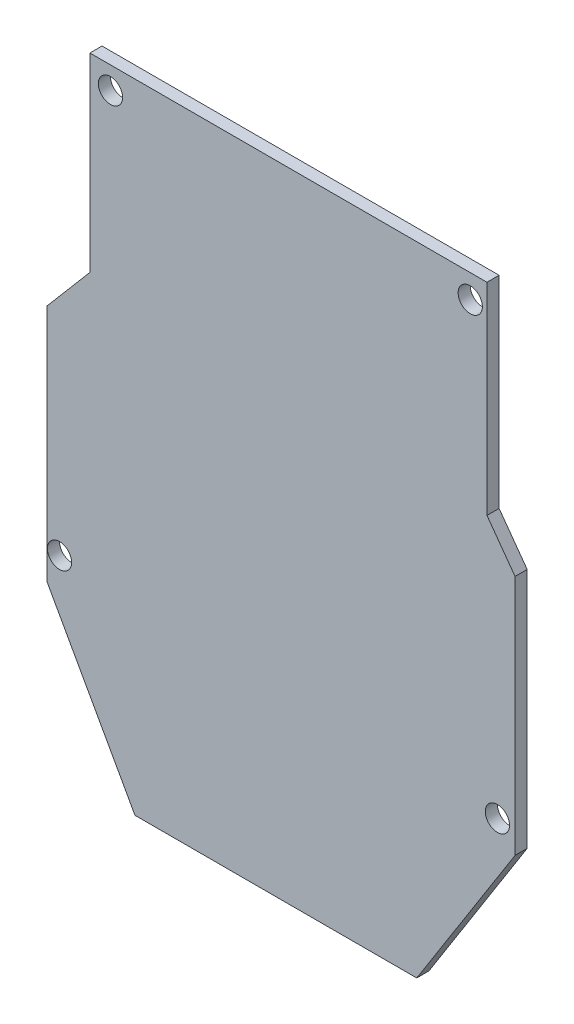
ISO-10303-21;
HEADER;
FILE_DESCRIPTION(('STEP AP214'),'2;1');
FILE_NAME('part.step','',(''),(''),'','','');
FILE_SCHEMA(('AUTOMOTIVE_DESIGN { 1 0 10303 214 1 1 1 1 }'));
ENDSEC;
DATA;
#1=APPLICATION_CONTEXT('core data for automotive mechanical design processes');
#2=APPLICATION_PROTOCOL_DEFINITION('international standard','automotive_design',2000,#1);
#3=PRODUCT_CONTEXT('',#1,'mechanical');
#4=PRODUCT('Part','Part','',(#3));
#5=PRODUCT_RELATED_PRODUCT_CATEGORY('part','',(#4));
#6=PRODUCT_DEFINITION_FORMATION('','',#4);
#7=PRODUCT_DEFINITION_CONTEXT('part definition',#1,'design');
#8=PRODUCT_DEFINITION('design','',#6,#7);
#9=PRODUCT_DEFINITION_SHAPE('','',#8);
#10=(LENGTH_UNIT() NAMED_UNIT(*) SI_UNIT(.MILLI.,.METRE.));
#11=(NAMED_UNIT(*) PLANE_ANGLE_UNIT() SI_UNIT($,.RADIAN.));
#12=(NAMED_UNIT(*) SI_UNIT($,.STERADIAN.) SOLID_ANGLE_UNIT());
#13=UNCERTAINTY_MEASURE_WITH_UNIT(LENGTH_MEASURE(1.E-05),#10,'distance_accuracy_value','');
#14=(GEOMETRIC_REPRESENTATION_CONTEXT(3) GLOBAL_UNCERTAINTY_ASSIGNED_CONTEXT((#13)) GLOBAL_UNIT_ASSIGNED_CONTEXT((#10,
#11,#12)) REPRESENTATION_CONTEXT('',''));
#15=CARTESIAN_POINT('',(0.,0.,0.));
#16=DIRECTION('',(0.,0.,1.));
#17=DIRECTION('',(1.,0.,0.));
#18=AXIS2_PLACEMENT_3D('',#15,#16,#17);
#19=CARTESIAN_POINT('',(0.,0.,2.));
#20=DIRECTION('',(0.,0.,1.));
#21=DIRECTION('',(1.,0.,0.));
#22=AXIS2_PLACEMENT_3D('',#19,#20,#21);
#23=PLANE('',#22);
#24=CARTESIAN_POINT('',(-29.9294300001334,-18.0638166786858,2.));
#25=DIRECTION('',(0.,0.,1.));
#26=DIRECTION('',(1.,0.,0.));
#27=AXIS2_PLACEMENT_3D('',#24,#25,#26);
#28=CIRCLE('',#27,2.);
#29=CARTESIAN_POINT('',(-27.9294300001334,-18.0638166786858,2.));
#30=VERTEX_POINT('',#29);
#31=EDGE_CURVE('E218',#30,#30,#28,.T.);
#32=ORIENTED_EDGE('',*,*,#31,.F.);
#33=EDGE_LOOP('',(#32));
#34=FACE_BOUND('',#33,.T.);
#35=CARTESIAN_POINT('',(37.8556439314561,52.3886463427061,2.));
#36=DIRECTION('',(0.,0.,1.));
#37=DIRECTION('',(1.,0.,0.));
#38=AXIS2_PLACEMENT_3D('',#35,#36,#37);
#39=CIRCLE('',#38,2.);
#40=CARTESIAN_POINT('',(39.8556439314561,52.3886463427061,2.));
#41=VERTEX_POINT('',#40);
#42=EDGE_CURVE('E146',#41,#41,#39,.T.);
#43=ORIENTED_EDGE('',*,*,#42,.F.);
#44=EDGE_LOOP('',(#43));
#45=FACE_BOUND('',#44,.T.);
#46=DIRECTION('',(0.,-1.,0.));
#47=VECTOR('',#46,1.);
#48=CARTESIAN_POINT('',(-32.0233866048945,16.5425896414462,2.));
#49=LINE('',#48,#47);
#50=CARTESIAN_POINT('',(-32.0233866048945,16.5425896414462,2.));
#51=VERTEX_POINT('',#50);
#52=CARTESIAN_POINT('',(-32.0233866048944,-22.7820787074679,2.));
#53=VERTEX_POINT('',#52);
#54=EDGE_CURVE('E161',#51,#53,#49,.T.);
#55=ORIENTED_EDGE('',*,*,#54,.T.);
#56=DIRECTION('',(0.48563647935583,-0.874160860436381,0.));
#57=VECTOR('',#56,1.);
#58=CARTESIAN_POINT('',(-32.0233866048944,-22.7820787074679,2.));
#59=LINE('',#58,#57);
#60=CARTESIAN_POINT('',(-17.4758081145362,-48.9681752446671,2.));
#61=VERTEX_POINT('',#60);
#62=EDGE_CURVE('E99',#53,#61,#59,.T.);
#63=ORIENTED_EDGE('',*,*,#62,.T.);
#64=DIRECTION('',(1.,0.,0.));
#65=VECTOR('',#64,1.);
#66=CARTESIAN_POINT('',(-17.4758081145362,-48.9681752446671,2.));
#67=LINE('',#66,#65);
#68=CARTESIAN_POINT('',(29.0280504281764,-48.9681752446671,2.));
#69=VERTEX_POINT('',#68);
#70=EDGE_CURVE('E182',#61,#69,#67,.T.);
#71=ORIENTED_EDGE('',*,*,#70,.T.);
#72=DIRECTION('',(0.534865218650777,0.844937392874559,0.));
#73=VECTOR('',#72,1.);
#74=CARTESIAN_POINT('',(29.0280504281764,-48.9681752446671,2.));
#75=LINE('',#74,#73);
#76=CARTESIAN_POINT('',(45.2543705157378,-23.3351295489367,2.));
#77=VERTEX_POINT('',#76);
#78=EDGE_CURVE('E201',#69,#77,#75,.T.);
#79=ORIENTED_EDGE('',*,*,#78,.T.);
#80=DIRECTION('',(0.,1.,0.));
#81=VECTOR('',#80,1.);
#82=CARTESIAN_POINT('',(45.2543705157378,16.5425896414462,2.));
#83=LINE('',#82,#81);
#84=CARTESIAN_POINT('',(45.2543705157378,16.5425896414462,2.));
#85=VERTEX_POINT('',#84);
#86=EDGE_CURVE('E198',#77,#85,#83,.T.);
#87=ORIENTED_EDGE('',*,*,#86,.T.);
#88=DIRECTION('',(-0.586677283629059,0.80982082269699,0.));
#89=VECTOR('',#88,1.);
#90=CARTESIAN_POINT('',(40.6167722943638,22.9441049408621,2.));
#91=LINE('',#90,#89);
#92=CARTESIAN_POINT('',(40.6167722943638,22.9441049408621,2.));
#93=VERTEX_POINT('',#92);
#94=EDGE_CURVE('E200',#85,#93,#91,.T.);
#95=ORIENTED_EDGE('',*,*,#94,.T.);
#96=DIRECTION('',(0.,1.,0.));
#97=VECTOR('',#96,1.);
#98=CARTESIAN_POINT('',(40.6167722943638,56.2694611492134,2.));
#99=LINE('',#98,#97);
#100=CARTESIAN_POINT('',(40.6167722943638,56.2694611492134,2.));
#101=VERTEX_POINT('',#100);
#102=EDGE_CURVE('E124',#93,#101,#99,.T.);
#103=ORIENTED_EDGE('',*,*,#102,.T.);
#104=DIRECTION('',(-1.,0.,0.));
#105=VECTOR('',#104,1.);
#106=CARTESIAN_POINT('',(-24.9134695496944,56.2694611492134,2.));
#107=LINE('',#106,#105);
#108=CARTESIAN_POINT('',(-24.9134695496944,56.2694611492134,2.));
#109=VERTEX_POINT('',#108);
#110=EDGE_CURVE('E118',#101,#109,#107,.T.);
#111=ORIENTED_EDGE('',*,*,#110,.T.);
#112=DIRECTION('',(0.,-1.,0.));
#113=VECTOR('',#112,1.);
#114=CARTESIAN_POINT('',(-24.9134695496944,24.9114311912706,2.));
#115=LINE('',#114,#113);
#116=CARTESIAN_POINT('',(-24.9134695496944,24.9114311912706,2.));
#117=VERTEX_POINT('',#116);
#118=EDGE_CURVE('E122',#109,#117,#115,.T.);
#119=ORIENTED_EDGE('',*,*,#118,.T.);
#120=DIRECTION('',(-0.647458169147132,-0.762100990161175,0.));
#121=VECTOR('',#120,1.);
#122=CARTESIAN_POINT('',(-32.0233866048945,16.5425896414462,2.));
#123=LINE('',#122,#121);
#124=EDGE_CURVE('E50',#117,#51,#123,.T.);
#125=ORIENTED_EDGE('',*,*,#124,.T.);
#126=EDGE_LOOP('',(#55,#63,#71,#79,#87,#95,#103,#111,#119,#125));
#127=FACE_BOUND('',#126,.T.);
#128=CARTESIAN_POINT('',(42.3406789381386,-19.5084352557195,2.));
#129=DIRECTION('',(0.,0.,1.));
#130=DIRECTION('',(1.,0.,0.));
#131=AXIS2_PLACEMENT_3D('',#128,#129,#130);
#132=CIRCLE('',#131,2.);
#133=CARTESIAN_POINT('',(44.3406789381386,-19.5084352557195,2.));
#134=VERTEX_POINT('',#133);
#135=EDGE_CURVE('E212',#134,#134,#132,.T.);
#136=ORIENTED_EDGE('',*,*,#135,.F.);
#137=EDGE_LOOP('',(#136));
#138=FACE_BOUND('',#137,.T.);
#139=CARTESIAN_POINT('',(-21.5227344928328,52.6011081918831,2.));
#140=DIRECTION('',(0.,0.,1.));
#141=DIRECTION('',(1.,0.,0.));
#142=AXIS2_PLACEMENT_3D('',#139,#140,#141);
#143=CIRCLE('',#142,2.);
#144=CARTESIAN_POINT('',(-19.5227344928328,52.6011081918831,2.));
#145=VERTEX_POINT('',#144);
#146=EDGE_CURVE('E224',#145,#145,#143,.T.);
#147=ORIENTED_EDGE('',*,*,#146,.F.);
#148=EDGE_LOOP('',(#147));
#149=FACE_BOUND('',#148,.T.);
#150=ADVANCED_FACE('F33',(#34,#45,#127,#138,#149),#23,.T.);
#151=CARTESIAN_POINT('',(0.,0.,0.));
#152=DIRECTION('',(0.,0.,1.));
#153=DIRECTION('',(1.,0.,0.));
#154=AXIS2_PLACEMENT_3D('',#151,#152,#153);
#155=PLANE('',#154);
#156=DIRECTION('',(0.,-1.,0.));
#157=VECTOR('',#156,1.);
#158=CARTESIAN_POINT('',(-32.0233866048945,16.5425896414462,0.));
#159=LINE('',#158,#157);
#160=CARTESIAN_POINT('',(-32.0233866048945,16.5425896414462,0.));
#161=VERTEX_POINT('',#160);
#162=CARTESIAN_POINT('',(-32.0233866048944,-22.7820787074679,0.));
#163=VERTEX_POINT('',#162);
#164=EDGE_CURVE('E142',#161,#163,#159,.T.);
#165=ORIENTED_EDGE('',*,*,#164,.F.);
#166=DIRECTION('',(-0.647458169147132,-0.762100990161175,0.));
#167=VECTOR('',#166,1.);
#168=CARTESIAN_POINT('',(-32.0233866048945,16.5425896414462,0.));
#169=LINE('',#168,#167);
#170=CARTESIAN_POINT('',(-24.9134695496944,24.9114311912706,0.));
#171=VERTEX_POINT('',#170);
#172=EDGE_CURVE('E91',#171,#161,#169,.T.);
#173=ORIENTED_EDGE('',*,*,#172,.F.);
#174=DIRECTION('',(0.,-1.,0.));
#175=VECTOR('',#174,1.);
#176=CARTESIAN_POINT('',(-24.9134695496944,24.9114311912706,0.));
#177=LINE('',#176,#175);
#178=CARTESIAN_POINT('',(-24.9134695496944,56.2694611492134,0.));
#179=VERTEX_POINT('',#178);
#180=EDGE_CURVE('E85',#179,#171,#177,.T.);
#181=ORIENTED_EDGE('',*,*,#180,.F.);
#182=DIRECTION('',(-1.,0.,0.));
#183=VECTOR('',#182,1.);
#184=CARTESIAN_POINT('',(-24.9134695496944,56.2694611492134,0.));
#185=LINE('',#184,#183);
#186=CARTESIAN_POINT('',(40.6167722943638,56.2694611492134,0.));
#187=VERTEX_POINT('',#186);
#188=EDGE_CURVE('E132',#187,#179,#185,.T.);
#189=ORIENTED_EDGE('',*,*,#188,.F.);
#190=DIRECTION('',(0.,1.,0.));
#191=VECTOR('',#190,1.);
#192=CARTESIAN_POINT('',(40.6167722943638,56.2694611492134,0.));
#193=LINE('',#192,#191);
#194=CARTESIAN_POINT('',(40.6167722943638,22.9441049408621,0.));
#195=VERTEX_POINT('',#194);
#196=EDGE_CURVE('E156',#195,#187,#193,.T.);
#197=ORIENTED_EDGE('',*,*,#196,.F.);
#198=DIRECTION('',(-0.586677283629059,0.80982082269699,0.));
#199=VECTOR('',#198,1.);
#200=CARTESIAN_POINT('',(40.6167722943638,22.9441049408621,0.));
#201=LINE('',#200,#199);
#202=CARTESIAN_POINT('',(45.2543705157378,16.5425896414462,0.));
#203=VERTEX_POINT('',#202);
#204=EDGE_CURVE('E154',#203,#195,#201,.T.);
#205=ORIENTED_EDGE('',*,*,#204,.F.);
#206=DIRECTION('',(0.,1.,0.));
#207=VECTOR('',#206,1.);
#208=CARTESIAN_POINT('',(45.2543705157378,16.5425896414462,0.));
#209=LINE('',#208,#207);
#210=CARTESIAN_POINT('',(45.2543705157378,-23.3351295489367,0.));
#211=VERTEX_POINT('',#210);
#212=EDGE_CURVE('E152',#211,#203,#209,.T.);
#213=ORIENTED_EDGE('',*,*,#212,.F.);
#214=DIRECTION('',(0.534865218650777,0.844937392874559,0.));
#215=VECTOR('',#214,1.);
#216=CARTESIAN_POINT('',(29.0280504281764,-48.9681752446671,0.));
#217=LINE('',#216,#215);
#218=CARTESIAN_POINT('',(29.0280504281764,-48.9681752446671,0.));
#219=VERTEX_POINT('',#218);
#220=EDGE_CURVE('E150',#219,#211,#217,.T.);
#221=ORIENTED_EDGE('',*,*,#220,.F.);
#222=DIRECTION('',(1.,0.,0.));
#223=VECTOR('',#222,1.);
#224=CARTESIAN_POINT('',(-17.4758081145362,-48.9681752446671,0.));
#225=LINE('',#224,#223);
#226=CARTESIAN_POINT('',(-17.4758081145362,-48.9681752446671,0.));
#227=VERTEX_POINT('',#226);
#228=EDGE_CURVE('E148',#227,#219,#225,.T.);
#229=ORIENTED_EDGE('',*,*,#228,.F.);
#230=DIRECTION('',(0.48563647935583,-0.874160860436381,0.));
#231=VECTOR('',#230,1.);
#232=CARTESIAN_POINT('',(-32.0233866048944,-22.7820787074679,0.));
#233=LINE('',#232,#231);
#234=EDGE_CURVE('E145',#163,#227,#233,.T.);
#235=ORIENTED_EDGE('',*,*,#234,.F.);
#236=EDGE_LOOP('',(#165,#173,#181,#189,#197,#205,#213,#221,#229,#235));
#237=FACE_BOUND('',#236,.T.);
#238=CARTESIAN_POINT('',(37.8556439314561,52.3886463427061,0.));
#239=DIRECTION('',(0.,0.,1.));
#240=DIRECTION('',(1.,0.,0.));
#241=AXIS2_PLACEMENT_3D('',#238,#239,#240);
#242=CIRCLE('',#241,2.);
#243=CARTESIAN_POINT('',(39.8556439314561,52.3886463427061,0.));
#244=VERTEX_POINT('',#243);
#245=EDGE_CURVE('E209',#244,#244,#242,.T.);
#246=ORIENTED_EDGE('',*,*,#245,.T.);
#247=EDGE_LOOP('',(#246));
#248=FACE_BOUND('',#247,.T.);
#249=CARTESIAN_POINT('',(42.3406789381386,-19.5084352557195,0.));
#250=DIRECTION('',(0.,0.,1.));
#251=DIRECTION('',(1.,0.,0.));
#252=AXIS2_PLACEMENT_3D('',#249,#250,#251);
#253=CIRCLE('',#252,2.);
#254=CARTESIAN_POINT('',(44.3406789381386,-19.5084352557195,0.));
#255=VERTEX_POINT('',#254);
#256=EDGE_CURVE('E215',#255,#255,#253,.T.);
#257=ORIENTED_EDGE('',*,*,#256,.T.);
#258=EDGE_LOOP('',(#257));
#259=FACE_BOUND('',#258,.T.);
#260=CARTESIAN_POINT('',(-29.9294300001334,-18.0638166786858,0.));
#261=DIRECTION('',(0.,0.,1.));
#262=DIRECTION('',(1.,0.,0.));
#263=AXIS2_PLACEMENT_3D('',#260,#261,#262);
#264=CIRCLE('',#263,2.);
#265=CARTESIAN_POINT('',(-27.9294300001334,-18.0638166786858,0.));
#266=VERTEX_POINT('',#265);
#267=EDGE_CURVE('E221',#266,#266,#264,.T.);
#268=ORIENTED_EDGE('',*,*,#267,.T.);
#269=EDGE_LOOP('',(#268));
#270=FACE_BOUND('',#269,.T.);
#271=CARTESIAN_POINT('',(-21.5227344928328,52.6011081918831,0.));
#272=DIRECTION('',(0.,0.,1.));
#273=DIRECTION('',(1.,0.,0.));
#274=AXIS2_PLACEMENT_3D('',#271,#272,#273);
#275=CIRCLE('',#274,2.);
#276=CARTESIAN_POINT('',(-19.5227344928328,52.6011081918831,0.));
#277=VERTEX_POINT('',#276);
#278=EDGE_CURVE('E227',#277,#277,#275,.T.);
#279=ORIENTED_EDGE('',*,*,#278,.T.);
#280=EDGE_LOOP('',(#279));
#281=FACE_BOUND('',#280,.T.);
#282=ADVANCED_FACE('F186',(#237,#248,#259,#270,#281),#155,.F.);
#283=CARTESIAN_POINT('',(-32.0233866048945,16.5425896414462,2.));
#284=DIRECTION('',(1.,0.,0.));
#285=DIRECTION('',(0.,1.,0.));
#286=AXIS2_PLACEMENT_3D('',#283,#284,#285);
#287=PLANE('',#286);
#288=ORIENTED_EDGE('',*,*,#164,.T.);
#289=DIRECTION('',(0.,0.,-1.));
#290=VECTOR('',#289,1.);
#291=CARTESIAN_POINT('',(-32.0233866048944,-22.7820787074679,2.));
#292=LINE('',#291,#290);
#293=EDGE_CURVE('E11',#53,#163,#292,.T.);
#294=ORIENTED_EDGE('',*,*,#293,.F.);
#295=ORIENTED_EDGE('',*,*,#54,.F.);
#296=DIRECTION('',(0.,0.,-1.));
#297=VECTOR('',#296,1.);
#298=CARTESIAN_POINT('',(-32.0233866048945,16.5425896414462,2.));
#299=LINE('',#298,#297);
#300=EDGE_CURVE('E138',#51,#161,#299,.T.);
#301=ORIENTED_EDGE('',*,*,#300,.T.);
#302=EDGE_LOOP('',(#288,#294,#295,#301));
#303=FACE_BOUND('',#302,.T.);
#304=ADVANCED_FACE('F35',(#303),#287,.F.);
#305=CARTESIAN_POINT('',(-32.0233866048944,-22.7820787074679,2.));
#306=DIRECTION('',(0.874160860436381,0.48563647935583,0.));
#307=DIRECTION('',(-0.48563647935583,0.874160860436381,0.));
#308=AXIS2_PLACEMENT_3D('',#305,#306,#307);
#309=PLANE('',#308);
#310=ORIENTED_EDGE('',*,*,#234,.T.);
#311=DIRECTION('',(0.,0.,-1.));
#312=VECTOR('',#311,1.);
#313=CARTESIAN_POINT('',(-17.4758081145362,-48.9681752446671,2.));
#314=LINE('',#313,#312);
#315=EDGE_CURVE('E42',#61,#227,#314,.T.);
#316=ORIENTED_EDGE('',*,*,#315,.F.);
#317=ORIENTED_EDGE('',*,*,#62,.F.);
#318=ORIENTED_EDGE('',*,*,#293,.T.);
#319=EDGE_LOOP('',(#310,#316,#317,#318));
#320=FACE_BOUND('',#319,.T.);
#321=ADVANCED_FACE('F269',(#320),#309,.F.);
#322=CARTESIAN_POINT('',(-17.4758081145362,-48.9681752446671,2.));
#323=DIRECTION('',(0.,1.,0.));
#324=DIRECTION('',(0.,0.,1.));
#325=AXIS2_PLACEMENT_3D('',#322,#323,#324);
#326=PLANE('',#325);
#327=ORIENTED_EDGE('',*,*,#228,.T.);
#328=DIRECTION('',(0.,0.,-1.));
#329=VECTOR('',#328,1.);
#330=CARTESIAN_POINT('',(29.0280504281764,-48.9681752446671,2.));
#331=LINE('',#330,#329);
#332=EDGE_CURVE('E174',#69,#219,#331,.T.);
#333=ORIENTED_EDGE('',*,*,#332,.F.);
#334=ORIENTED_EDGE('',*,*,#70,.F.);
#335=ORIENTED_EDGE('',*,*,#315,.T.);
#336=EDGE_LOOP('',(#327,#333,#334,#335));
#337=FACE_BOUND('',#336,.T.);
#338=ADVANCED_FACE('F180',(#337),#326,.F.);
#339=CARTESIAN_POINT('',(29.0280504281764,-48.9681752446671,2.));
#340=DIRECTION('',(-0.844937392874559,0.534865218650777,0.));
#341=DIRECTION('',(-0.534865218650777,-0.844937392874559,0.));
#342=AXIS2_PLACEMENT_3D('',#339,#340,#341);
#343=PLANE('',#342);
#344=ORIENTED_EDGE('',*,*,#220,.T.);
#345=DIRECTION('',(0.,0.,-1.));
#346=VECTOR('',#345,1.);
#347=CARTESIAN_POINT('',(45.2543705157378,-23.3351295489367,2.));
#348=LINE('',#347,#346);
#349=EDGE_CURVE('E171',#77,#211,#348,.T.);
#350=ORIENTED_EDGE('',*,*,#349,.F.);
#351=ORIENTED_EDGE('',*,*,#78,.F.);
#352=ORIENTED_EDGE('',*,*,#332,.T.);
#353=EDGE_LOOP('',(#344,#350,#351,#352));
#354=FACE_BOUND('',#353,.T.);
#355=ADVANCED_FACE('F192',(#354),#343,.F.);
#356=CARTESIAN_POINT('',(45.2543705157378,16.5425896414462,2.));
#357=DIRECTION('',(-1.,0.,0.));
#358=DIRECTION('',(0.,0.,1.));
#359=AXIS2_PLACEMENT_3D('',#356,#357,#358);
#360=PLANE('',#359);
#361=ORIENTED_EDGE('',*,*,#212,.T.);
#362=DIRECTION('',(0.,0.,-1.));
#363=VECTOR('',#362,1.);
#364=CARTESIAN_POINT('',(45.2543705157378,16.5425896414462,2.));
#365=LINE('',#364,#363);
#366=EDGE_CURVE('E168',#85,#203,#365,.T.);
#367=ORIENTED_EDGE('',*,*,#366,.F.);
#368=ORIENTED_EDGE('',*,*,#86,.F.);
#369=ORIENTED_EDGE('',*,*,#349,.T.);
#370=EDGE_LOOP('',(#361,#367,#368,#369));
#371=FACE_BOUND('',#370,.T.);
#372=ADVANCED_FACE('F196',(#371),#360,.F.);
#373=CARTESIAN_POINT('',(40.6167722943638,22.9441049408621,2.));
#374=DIRECTION('',(-0.80982082269699,-0.586677283629059,0.));
#375=DIRECTION('',(0.586677283629059,-0.80982082269699,0.));
#376=AXIS2_PLACEMENT_3D('',#373,#374,#375);
#377=PLANE('',#376);
#378=ORIENTED_EDGE('',*,*,#204,.T.);
#379=DIRECTION('',(0.,0.,-1.));
#380=VECTOR('',#379,1.);
#381=CARTESIAN_POINT('',(40.6167722943638,22.9441049408621,2.));
#382=LINE('',#381,#380);
#383=EDGE_CURVE('E165',#93,#195,#382,.T.);
#384=ORIENTED_EDGE('',*,*,#383,.F.);
#385=ORIENTED_EDGE('',*,*,#94,.F.);
#386=ORIENTED_EDGE('',*,*,#366,.T.);
#387=EDGE_LOOP('',(#378,#384,#385,#386));
#388=FACE_BOUND('',#387,.T.);
#389=ADVANCED_FACE('F259',(#388),#377,.F.);
#390=CARTESIAN_POINT('',(40.6167722943638,56.2694611492134,2.));
#391=DIRECTION('',(-1.,0.,0.));
#392=DIRECTION('',(0.,0.,1.));
#393=AXIS2_PLACEMENT_3D('',#390,#391,#392);
#394=PLANE('',#393);
#395=ORIENTED_EDGE('',*,*,#196,.T.);
#396=DIRECTION('',(0.,0.,-1.));
#397=VECTOR('',#396,1.);
#398=CARTESIAN_POINT('',(40.6167722943638,56.2694611492134,2.));
#399=LINE('',#398,#397);
#400=EDGE_CURVE('E133',#101,#187,#399,.T.);
#401=ORIENTED_EDGE('',*,*,#400,.F.);
#402=ORIENTED_EDGE('',*,*,#102,.F.);
#403=ORIENTED_EDGE('',*,*,#383,.T.);
#404=EDGE_LOOP('',(#395,#401,#402,#403));
#405=FACE_BOUND('',#404,.T.);
#406=ADVANCED_FACE('F256',(#405),#394,.F.);
#407=CARTESIAN_POINT('',(-24.9134695496944,56.2694611492134,2.));
#408=DIRECTION('',(0.,-1.,0.));
#409=DIRECTION('',(0.,0.,-1.));
#410=AXIS2_PLACEMENT_3D('',#407,#408,#409);
#411=PLANE('',#410);
#412=ORIENTED_EDGE('',*,*,#188,.T.);
#413=DIRECTION('',(0.,0.,-1.));
#414=VECTOR('',#413,1.);
#415=CARTESIAN_POINT('',(-24.9134695496944,56.2694611492134,2.));
#416=LINE('',#415,#414);
#417=EDGE_CURVE('E129',#109,#179,#416,.T.);
#418=ORIENTED_EDGE('',*,*,#417,.F.);
#419=ORIENTED_EDGE('',*,*,#110,.F.);
#420=ORIENTED_EDGE('',*,*,#400,.T.);
#421=EDGE_LOOP('',(#412,#418,#419,#420));
#422=FACE_BOUND('',#421,.T.);
#423=ADVANCED_FACE('F130',(#422),#411,.F.);
#424=CARTESIAN_POINT('',(-24.9134695496944,24.9114311912706,2.));
#425=DIRECTION('',(1.,0.,0.));
#426=DIRECTION('',(0.,0.,-1.));
#427=AXIS2_PLACEMENT_3D('',#424,#425,#426);
#428=PLANE('',#427);
#429=ORIENTED_EDGE('',*,*,#180,.T.);
#430=DIRECTION('',(0.,0.,-1.));
#431=VECTOR('',#430,1.);
#432=CARTESIAN_POINT('',(-24.9134695496944,24.9114311912706,2.));
#433=LINE('',#432,#431);
#434=EDGE_CURVE('E134',#117,#171,#433,.T.);
#435=ORIENTED_EDGE('',*,*,#434,.F.);
#436=ORIENTED_EDGE('',*,*,#118,.F.);
#437=ORIENTED_EDGE('',*,*,#417,.T.);
#438=EDGE_LOOP('',(#429,#435,#436,#437));
#439=FACE_BOUND('',#438,.T.);
#440=ADVANCED_FACE('F136',(#439),#428,.F.);
#441=CARTESIAN_POINT('',(-32.0233866048945,16.5425896414462,2.));
#442=DIRECTION('',(0.762100990161175,-0.647458169147132,0.));
#443=DIRECTION('',(0.647458169147132,0.762100990161175,0.));
#444=AXIS2_PLACEMENT_3D('',#441,#442,#443);
#445=PLANE('',#444);
#446=ORIENTED_EDGE('',*,*,#172,.T.);
#447=ORIENTED_EDGE('',*,*,#300,.F.);
#448=ORIENTED_EDGE('',*,*,#124,.F.);
#449=ORIENTED_EDGE('',*,*,#434,.T.);
#450=EDGE_LOOP('',(#446,#447,#448,#449));
#451=FACE_BOUND('',#450,.T.);
#452=ADVANCED_FACE('F249',(#451),#445,.F.);
#453=CARTESIAN_POINT('',(37.8556439314561,52.3886463427061,2.));
#454=DIRECTION('',(0.,0.,-1.));
#455=DIRECTION('',(-1.,0.,0.));
#456=AXIS2_PLACEMENT_3D('',#453,#454,#455);
#457=CYLINDRICAL_SURFACE('',#456,2.);
#458=ORIENTED_EDGE('',*,*,#42,.T.);
#459=EDGE_LOOP('',(#458));
#460=FACE_BOUND('',#459,.T.);
#461=ORIENTED_EDGE('',*,*,#245,.F.);
#462=EDGE_LOOP('',(#461));
#463=FACE_BOUND('',#462,.T.);
#464=ADVANCED_FACE('F246',(#460,#463),#457,.F.);
#465=CARTESIAN_POINT('',(42.3406789381386,-19.5084352557195,2.));
#466=DIRECTION('',(0.,0.,-1.));
#467=DIRECTION('',(-1.,0.,0.));
#468=AXIS2_PLACEMENT_3D('',#465,#466,#467);
#469=CYLINDRICAL_SURFACE('',#468,2.);
#470=ORIENTED_EDGE('',*,*,#135,.T.);
#471=EDGE_LOOP('',(#470));
#472=FACE_BOUND('',#471,.T.);
#473=ORIENTED_EDGE('',*,*,#256,.F.);
#474=EDGE_LOOP('',(#473));
#475=FACE_BOUND('',#474,.T.);
#476=ADVANCED_FACE('F345',(#472,#475),#469,.F.);
#477=CARTESIAN_POINT('',(-29.9294300001334,-18.0638166786858,2.));
#478=DIRECTION('',(0.,0.,-1.));
#479=DIRECTION('',(-1.,0.,0.));
#480=AXIS2_PLACEMENT_3D('',#477,#478,#479);
#481=CYLINDRICAL_SURFACE('',#480,2.);
#482=ORIENTED_EDGE('',*,*,#31,.T.);
#483=EDGE_LOOP('',(#482));
#484=FACE_BOUND('',#483,.T.);
#485=ORIENTED_EDGE('',*,*,#267,.F.);
#486=EDGE_LOOP('',(#485));
#487=FACE_BOUND('',#486,.T.);
#488=ADVANCED_FACE('F353',(#484,#487),#481,.F.);
#489=CARTESIAN_POINT('',(-21.5227344928328,52.6011081918831,2.));
#490=DIRECTION('',(0.,0.,-1.));
#491=DIRECTION('',(-1.,0.,0.));
#492=AXIS2_PLACEMENT_3D('',#489,#490,#491);
#493=CYLINDRICAL_SURFACE('',#492,2.);
#494=ORIENTED_EDGE('',*,*,#146,.T.);
#495=EDGE_LOOP('',(#494));
#496=FACE_BOUND('',#495,.T.);
#497=ORIENTED_EDGE('',*,*,#278,.F.);
#498=EDGE_LOOP('',(#497));
#499=FACE_BOUND('',#498,.T.);
#500=ADVANCED_FACE('F233',(#496,#499),#493,.F.);
#501=CLOSED_SHELL('',(#150,#282,#304,#321,#338,#355,#372,#389,#406,#423,#440,#452,#464,#476,
#488,#500));
#502=MANIFOLD_SOLID_BREP('B2',#501);
#503=ADVANCED_BREP_SHAPE_REPRESENTATION('',(#18,#502),#14);
#504=SHAPE_DEFINITION_REPRESENTATION(#9,#503);
ENDSEC;
END-ISO-10303-21;
